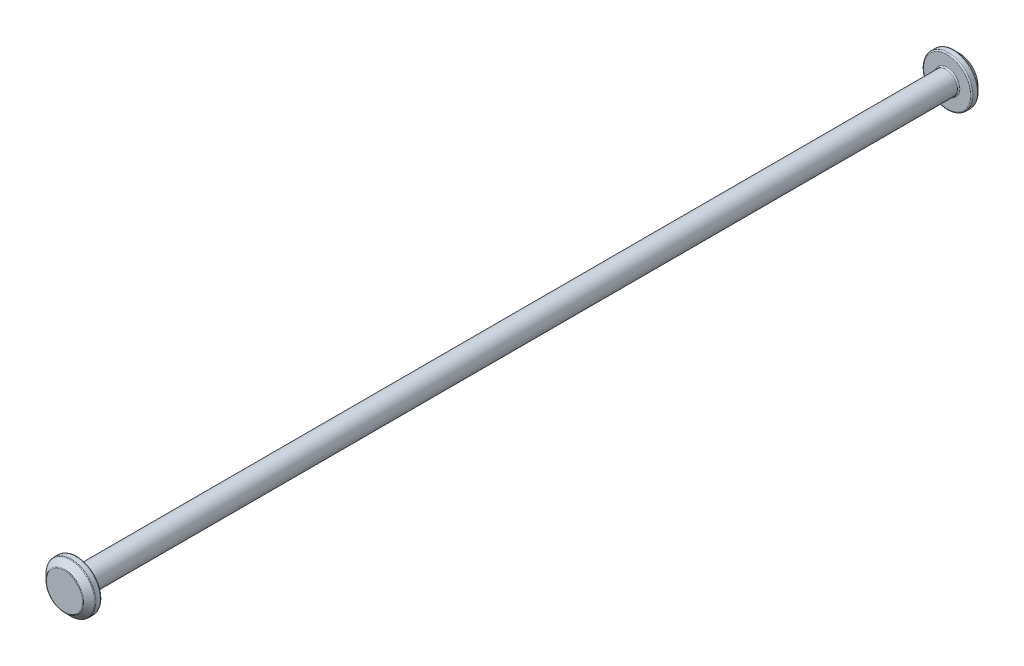
ISO-10303-21;
HEADER;
FILE_DESCRIPTION(('STEP AP214'),'2;1');
FILE_NAME('part.step','',(''),(''),'','','');
FILE_SCHEMA(('AUTOMOTIVE_DESIGN { 1 0 10303 214 1 1 1 1 }'));
ENDSEC;
DATA;
#1=APPLICATION_CONTEXT('core data for automotive mechanical design processes');
#2=APPLICATION_PROTOCOL_DEFINITION('international standard','automotive_design',2000,#1);
#3=PRODUCT_CONTEXT('',#1,'mechanical');
#4=PRODUCT('Part','Part','',(#3));
#5=PRODUCT_RELATED_PRODUCT_CATEGORY('part','',(#4));
#6=PRODUCT_DEFINITION_FORMATION('','',#4);
#7=PRODUCT_DEFINITION_CONTEXT('part definition',#1,'design');
#8=PRODUCT_DEFINITION('design','',#6,#7);
#9=PRODUCT_DEFINITION_SHAPE('','',#8);
#10=(LENGTH_UNIT() NAMED_UNIT(*) SI_UNIT(.MILLI.,.METRE.));
#11=(NAMED_UNIT(*) PLANE_ANGLE_UNIT() SI_UNIT($,.RADIAN.));
#12=(NAMED_UNIT(*) SI_UNIT($,.STERADIAN.) SOLID_ANGLE_UNIT());
#13=UNCERTAINTY_MEASURE_WITH_UNIT(LENGTH_MEASURE(1.E-05),#10,'distance_accuracy_value','');
#14=(GEOMETRIC_REPRESENTATION_CONTEXT(3) GLOBAL_UNCERTAINTY_ASSIGNED_CONTEXT((#13)) GLOBAL_UNIT_ASSIGNED_CONTEXT((#10,
#11,#12)) REPRESENTATION_CONTEXT('',''));
#15=CARTESIAN_POINT('',(0.,0.,0.));
#16=DIRECTION('',(0.,0.,1.));
#17=DIRECTION('',(1.,0.,0.));
#18=AXIS2_PLACEMENT_3D('',#15,#16,#17);
#19=CARTESIAN_POINT('',(0.,0.,35.25));
#20=DIRECTION('',(0.,0.,-1.));
#21=DIRECTION('',(-1.,0.,0.));
#22=AXIS2_PLACEMENT_3D('',#19,#20,#21);
#23=CYLINDRICAL_SURFACE('',#22,0.925);
#24=CARTESIAN_POINT('',(0.,0.,-35.15));
#25=DIRECTION('',(0.,0.,-1.));
#26=DIRECTION('',(-1.,0.,0.));
#27=AXIS2_PLACEMENT_3D('',#24,#25,#26);
#28=CIRCLE('',#27,0.925);
#29=CARTESIAN_POINT('',(-0.925,0.,-35.15));
#30=VERTEX_POINT('',#29);
#31=EDGE_CURVE('E87',#30,#30,#28,.F.);
#32=ORIENTED_EDGE('',*,*,#31,.T.);
#33=EDGE_LOOP('',(#32));
#34=FACE_BOUND('',#33,.T.);
#35=CARTESIAN_POINT('',(0.,0.,35.15));
#36=DIRECTION('',(0.,0.,1.));
#37=DIRECTION('',(1.,0.,0.));
#38=AXIS2_PLACEMENT_3D('',#35,#36,#37);
#39=CIRCLE('',#38,0.925);
#40=CARTESIAN_POINT('',(0.925,0.,35.15));
#41=VERTEX_POINT('',#40);
#42=EDGE_CURVE('E91',#41,#41,#39,.F.);
#43=ORIENTED_EDGE('',*,*,#42,.T.);
#44=EDGE_LOOP('',(#43));
#45=FACE_BOUND('',#44,.T.);
#46=ADVANCED_FACE('F39',(#34,#45),#23,.T.);
#47=CARTESIAN_POINT('',(0.,0.,36.25));
#48=DIRECTION('',(0.,0.,-1.));
#49=DIRECTION('',(-1.,0.,0.));
#50=AXIS2_PLACEMENT_3D('',#47,#48,#49);
#51=CYLINDRICAL_SURFACE('',#50,2.);
#52=CARTESIAN_POINT('',(0.,0.,35.35));
#53=DIRECTION('',(0.,0.,1.));
#54=DIRECTION('',(1.,0.,0.));
#55=AXIS2_PLACEMENT_3D('',#52,#53,#54);
#56=CIRCLE('',#55,2.);
#57=CARTESIAN_POINT('',(2.,0.,35.35));
#58=VERTEX_POINT('',#57);
#59=EDGE_CURVE('E67',#58,#58,#56,.T.);
#60=ORIENTED_EDGE('',*,*,#59,.T.);
#61=EDGE_LOOP('',(#60));
#62=FACE_BOUND('',#61,.T.);
#63=CARTESIAN_POINT('',(0.,0.,35.7085786437627));
#64=DIRECTION('',(0.,0.,1.));
#65=DIRECTION('',(1.,0.,0.));
#66=AXIS2_PLACEMENT_3D('',#63,#64,#65);
#67=CIRCLE('',#66,2.);
#68=CARTESIAN_POINT('',(2.,0.,35.7085786437627));
#69=VERTEX_POINT('',#68);
#70=EDGE_CURVE('E71',#69,#69,#67,.F.);
#71=ORIENTED_EDGE('',*,*,#70,.T.);
#72=EDGE_LOOP('',(#71));
#73=FACE_BOUND('',#72,.T.);
#74=ADVANCED_FACE('F124',(#62,#73),#51,.T.);
#75=CARTESIAN_POINT('',(0.,0.,36.25));
#76=DIRECTION('',(0.,0.,1.));
#77=DIRECTION('',(1.,0.,0.));
#78=AXIS2_PLACEMENT_3D('',#75,#76,#77);
#79=PLANE('',#78);
#80=CARTESIAN_POINT('',(0.,0.,36.25));
#81=DIRECTION('',(0.,0.,1.));
#82=DIRECTION('',(1.,0.,0.));
#83=AXIS2_PLACEMENT_3D('',#80,#81,#82);
#84=CIRCLE('',#83,1.4585786437627);
#85=CARTESIAN_POINT('',(1.4585786437627,0.,36.25));
#86=VERTEX_POINT('',#85);
#87=EDGE_CURVE('E10',#86,#86,#84,.T.);
#88=ORIENTED_EDGE('',*,*,#87,.T.);
#89=EDGE_LOOP('',(#88));
#90=FACE_BOUND('',#89,.T.);
#91=ADVANCED_FACE('F139',(#90),#79,.T.);
#92=CARTESIAN_POINT('',(0.,0.,35.25));
#93=DIRECTION('',(0.,0.,1.));
#94=DIRECTION('',(1.,0.,0.));
#95=AXIS2_PLACEMENT_3D('',#92,#93,#94);
#96=PLANE('',#95);
#97=CARTESIAN_POINT('',(0.,0.,35.25));
#98=DIRECTION('',(0.,0.,1.));
#99=DIRECTION('',(1.,0.,0.));
#100=AXIS2_PLACEMENT_3D('',#97,#98,#99);
#101=CIRCLE('',#100,1.9);
#102=CARTESIAN_POINT('',(1.9,0.,35.25));
#103=VERTEX_POINT('',#102);
#104=EDGE_CURVE('E57',#103,#103,#101,.F.);
#105=ORIENTED_EDGE('',*,*,#104,.T.);
#106=EDGE_LOOP('',(#105));
#107=FACE_BOUND('',#106,.T.);
#108=CARTESIAN_POINT('',(0.,0.,35.25));
#109=DIRECTION('',(0.,0.,1.));
#110=DIRECTION('',(1.,0.,0.));
#111=AXIS2_PLACEMENT_3D('',#108,#109,#110);
#112=CIRCLE('',#111,1.025);
#113=CARTESIAN_POINT('',(1.025,0.,35.25));
#114=VERTEX_POINT('',#113);
#115=EDGE_CURVE('E63',#114,#114,#112,.T.);
#116=ORIENTED_EDGE('',*,*,#115,.T.);
#117=EDGE_LOOP('',(#116));
#118=FACE_BOUND('',#117,.T.);
#119=ADVANCED_FACE('F136',(#107,#118),#96,.F.);
#120=CARTESIAN_POINT('',(0.,0.,36.25));
#121=DIRECTION('',(0.,0.,-1.));
#122=DIRECTION('',(-1.,0.,0.));
#123=AXIS2_PLACEMENT_3D('',#120,#121,#122);
#124=CONICAL_SURFACE('',#123,1.5,0.78539816339744);
#125=CARTESIAN_POINT('',(0.,0.,35.7792893218813));
#126=DIRECTION('',(0.,0.,-1.));
#127=DIRECTION('',(-1.,0.,0.));
#128=AXIS2_PLACEMENT_3D('',#125,#126,#127);
#129=CIRCLE('',#128,1.97071067811866);
#130=CARTESIAN_POINT('',(-1.97071067811866,0.,35.7792893218813));
#131=VERTEX_POINT('',#130);
#132=EDGE_CURVE('E47',#131,#131,#129,.F.);
#133=ORIENTED_EDGE('',*,*,#132,.T.);
#134=EDGE_LOOP('',(#133));
#135=FACE_BOUND('',#134,.T.);
#136=CARTESIAN_POINT('',(0.,0.,36.2207106781186));
#137=DIRECTION('',(0.,0.,1.));
#138=DIRECTION('',(1.,0.,0.));
#139=AXIS2_PLACEMENT_3D('',#136,#137,#138);
#140=CIRCLE('',#139,1.52928932188135);
#141=CARTESIAN_POINT('',(1.52928932188135,0.,36.2207106781186));
#142=VERTEX_POINT('',#141);
#143=EDGE_CURVE('E52',#142,#142,#140,.F.);
#144=ORIENTED_EDGE('',*,*,#143,.T.);
#145=EDGE_LOOP('',(#144));
#146=FACE_BOUND('',#145,.T.);
#147=ADVANCED_FACE('F138',(#135,#146),#124,.T.);
#148=CARTESIAN_POINT('',(0.,0.,-36.25));
#149=DIRECTION('',(0.,0.,1.));
#150=DIRECTION('',(-1.,0.,0.));
#151=AXIS2_PLACEMENT_3D('',#148,#149,#150);
#152=CYLINDRICAL_SURFACE('',#151,2.);
#153=CARTESIAN_POINT('',(0.,0.,-35.35));
#154=DIRECTION('',(0.,0.,-1.));
#155=DIRECTION('',(-1.,0.,0.));
#156=AXIS2_PLACEMENT_3D('',#153,#154,#155);
#157=CIRCLE('',#156,2.);
#158=CARTESIAN_POINT('',(-2.,0.,-35.35));
#159=VERTEX_POINT('',#158);
#160=EDGE_CURVE('E95',#159,#159,#157,.T.);
#161=ORIENTED_EDGE('',*,*,#160,.T.);
#162=EDGE_LOOP('',(#161));
#163=FACE_BOUND('',#162,.T.);
#164=CARTESIAN_POINT('',(0.,0.,-35.7085786437627));
#165=DIRECTION('',(0.,0.,1.));
#166=DIRECTION('',(1.,0.,0.));
#167=AXIS2_PLACEMENT_3D('',#164,#165,#166);
#168=CIRCLE('',#167,2.);
#169=CARTESIAN_POINT('',(2.,0.,-35.7085786437627));
#170=VERTEX_POINT('',#169);
#171=EDGE_CURVE('E99',#170,#170,#168,.T.);
#172=ORIENTED_EDGE('',*,*,#171,.T.);
#173=EDGE_LOOP('',(#172));
#174=FACE_BOUND('',#173,.T.);
#175=ADVANCED_FACE('F146',(#163,#174),#152,.T.);
#176=CARTESIAN_POINT('',(0.,0.,-36.25));
#177=DIRECTION('',(0.,0.,-1.));
#178=DIRECTION('',(1.,0.,0.));
#179=AXIS2_PLACEMENT_3D('',#176,#177,#178);
#180=PLANE('',#179);
#181=CARTESIAN_POINT('',(0.,0.,-36.25));
#182=DIRECTION('',(0.,0.,-1.));
#183=DIRECTION('',(-1.,0.,0.));
#184=AXIS2_PLACEMENT_3D('',#181,#182,#183);
#185=CIRCLE('',#184,1.4585786437627);
#186=CARTESIAN_POINT('',(-1.4585786437627,0.,-36.25));
#187=VERTEX_POINT('',#186);
#188=EDGE_CURVE('E75',#187,#187,#185,.T.);
#189=ORIENTED_EDGE('',*,*,#188,.T.);
#190=EDGE_LOOP('',(#189));
#191=FACE_BOUND('',#190,.T.);
#192=ADVANCED_FACE('F241',(#191),#180,.T.);
#193=CARTESIAN_POINT('',(0.,0.,-35.25));
#194=DIRECTION('',(0.,0.,-1.));
#195=DIRECTION('',(1.,0.,0.));
#196=AXIS2_PLACEMENT_3D('',#193,#194,#195);
#197=PLANE('',#196);
#198=CARTESIAN_POINT('',(0.,0.,-35.25));
#199=DIRECTION('',(0.,0.,-1.));
#200=DIRECTION('',(-1.,0.,0.));
#201=AXIS2_PLACEMENT_3D('',#198,#199,#200);
#202=CIRCLE('',#201,1.9);
#203=CARTESIAN_POINT('',(-1.9,0.,-35.25));
#204=VERTEX_POINT('',#203);
#205=EDGE_CURVE('E103',#204,#204,#202,.F.);
#206=ORIENTED_EDGE('',*,*,#205,.T.);
#207=EDGE_LOOP('',(#206));
#208=FACE_BOUND('',#207,.T.);
#209=CARTESIAN_POINT('',(0.,0.,-35.25));
#210=DIRECTION('',(0.,0.,-1.));
#211=DIRECTION('',(-1.,0.,0.));
#212=AXIS2_PLACEMENT_3D('',#209,#210,#211);
#213=CIRCLE('',#212,1.025);
#214=CARTESIAN_POINT('',(-1.025,0.,-35.25));
#215=VERTEX_POINT('',#214);
#216=EDGE_CURVE('E107',#215,#215,#213,.T.);
#217=ORIENTED_EDGE('',*,*,#216,.T.);
#218=EDGE_LOOP('',(#217));
#219=FACE_BOUND('',#218,.T.);
#220=ADVANCED_FACE('F112',(#208,#219),#197,.F.);
#221=CARTESIAN_POINT('',(0.,0.,-36.25));
#222=DIRECTION('',(0.,0.,1.));
#223=DIRECTION('',(-1.,0.,0.));
#224=AXIS2_PLACEMENT_3D('',#221,#222,#223);
#225=CONICAL_SURFACE('',#224,1.5,0.78539816339744);
#226=CARTESIAN_POINT('',(0.,0.,-36.2207106781186));
#227=DIRECTION('',(0.,0.,-1.));
#228=DIRECTION('',(-1.,0.,0.));
#229=AXIS2_PLACEMENT_3D('',#226,#227,#228);
#230=CIRCLE('',#229,1.52928932188135);
#231=CARTESIAN_POINT('',(-1.52928932188135,0.,-36.2207106781186));
#232=VERTEX_POINT('',#231);
#233=EDGE_CURVE('E79',#232,#232,#230,.F.);
#234=ORIENTED_EDGE('',*,*,#233,.T.);
#235=EDGE_LOOP('',(#234));
#236=FACE_BOUND('',#235,.T.);
#237=CARTESIAN_POINT('',(0.,0.,-35.7792893218813));
#238=DIRECTION('',(0.,0.,1.));
#239=DIRECTION('',(1.,0.,0.));
#240=AXIS2_PLACEMENT_3D('',#237,#238,#239);
#241=CIRCLE('',#240,1.97071067811866);
#242=CARTESIAN_POINT('',(1.97071067811866,0.,-35.7792893218813));
#243=VERTEX_POINT('',#242);
#244=EDGE_CURVE('E83',#243,#243,#241,.F.);
#245=ORIENTED_EDGE('',*,*,#244,.T.);
#246=EDGE_LOOP('',(#245));
#247=FACE_BOUND('',#246,.T.);
#248=ADVANCED_FACE('F158',(#236,#247),#225,.T.);
#249=CARTESIAN_POINT('',(0.,0.,-35.35));
#250=DIRECTION('',(0.,0.,-1.));
#251=DIRECTION('',(-1.,0.,0.));
#252=AXIS2_PLACEMENT_3D('',#249,#250,#251);
#253=TOROIDAL_SURFACE('',#252,1.9,0.1);
#254=ORIENTED_EDGE('',*,*,#160,.F.);
#255=EDGE_LOOP('',(#254));
#256=FACE_BOUND('',#255,.T.);
#257=ORIENTED_EDGE('',*,*,#205,.F.);
#258=EDGE_LOOP('',(#257));
#259=FACE_BOUND('',#258,.T.);
#260=ADVANCED_FACE('F118',(#256,#259),#253,.T.);
#261=CARTESIAN_POINT('',(0.,0.,-35.15));
#262=DIRECTION('',(0.,0.,-1.));
#263=DIRECTION('',(-1.,0.,0.));
#264=AXIS2_PLACEMENT_3D('',#261,#262,#263);
#265=TOROIDAL_SURFACE('',#264,1.025,0.1);
#266=ORIENTED_EDGE('',*,*,#216,.F.);
#267=EDGE_LOOP('',(#266));
#268=FACE_BOUND('',#267,.T.);
#269=ORIENTED_EDGE('',*,*,#31,.F.);
#270=EDGE_LOOP('',(#269));
#271=FACE_BOUND('',#270,.T.);
#272=ADVANCED_FACE('F114',(#268,#271),#265,.F.);
#273=CARTESIAN_POINT('',(0.,0.,-36.15));
#274=DIRECTION('',(0.,0.,-1.));
#275=DIRECTION('',(-1.,0.,0.));
#276=AXIS2_PLACEMENT_3D('',#273,#274,#275);
#277=TOROIDAL_SURFACE('',#276,1.4585786437627,0.1);
#278=ORIENTED_EDGE('',*,*,#188,.F.);
#279=EDGE_LOOP('',(#278));
#280=FACE_BOUND('',#279,.T.);
#281=ORIENTED_EDGE('',*,*,#233,.F.);
#282=EDGE_LOOP('',(#281));
#283=FACE_BOUND('',#282,.T.);
#284=ADVANCED_FACE('F117',(#280,#283),#277,.T.);
#285=CARTESIAN_POINT('',(0.,0.,-35.7085786437627));
#286=DIRECTION('',(0.,0.,1.));
#287=DIRECTION('',(1.,0.,0.));
#288=AXIS2_PLACEMENT_3D('',#285,#286,#287);
#289=TOROIDAL_SURFACE('',#288,1.9,0.1);
#290=ORIENTED_EDGE('',*,*,#171,.F.);
#291=EDGE_LOOP('',(#290));
#292=FACE_BOUND('',#291,.T.);
#293=ORIENTED_EDGE('',*,*,#244,.F.);
#294=EDGE_LOOP('',(#293));
#295=FACE_BOUND('',#294,.T.);
#296=ADVANCED_FACE('F163',(#292,#295),#289,.T.);
#297=CARTESIAN_POINT('',(0.,0.,35.35));
#298=DIRECTION('',(0.,0.,1.));
#299=DIRECTION('',(1.,0.,0.));
#300=AXIS2_PLACEMENT_3D('',#297,#298,#299);
#301=TOROIDAL_SURFACE('',#300,1.9,0.1);
#302=ORIENTED_EDGE('',*,*,#104,.F.);
#303=EDGE_LOOP('',(#302));
#304=FACE_BOUND('',#303,.T.);
#305=ORIENTED_EDGE('',*,*,#59,.F.);
#306=EDGE_LOOP('',(#305));
#307=FACE_BOUND('',#306,.T.);
#308=ADVANCED_FACE('F132',(#304,#307),#301,.T.);
#309=CARTESIAN_POINT('',(0.,0.,35.15));
#310=DIRECTION('',(0.,0.,1.));
#311=DIRECTION('',(1.,0.,0.));
#312=AXIS2_PLACEMENT_3D('',#309,#310,#311);
#313=TOROIDAL_SURFACE('',#312,1.025,0.1);
#314=ORIENTED_EDGE('',*,*,#42,.F.);
#315=EDGE_LOOP('',(#314));
#316=FACE_BOUND('',#315,.T.);
#317=ORIENTED_EDGE('',*,*,#115,.F.);
#318=EDGE_LOOP('',(#317));
#319=FACE_BOUND('',#318,.T.);
#320=ADVANCED_FACE('F128',(#316,#319),#313,.F.);
#321=CARTESIAN_POINT('',(0.,0.,35.7085786437627));
#322=DIRECTION('',(0.,0.,1.));
#323=DIRECTION('',(1.,0.,0.));
#324=AXIS2_PLACEMENT_3D('',#321,#322,#323);
#325=TOROIDAL_SURFACE('',#324,1.9,0.1);
#326=ORIENTED_EDGE('',*,*,#132,.F.);
#327=EDGE_LOOP('',(#326));
#328=FACE_BOUND('',#327,.T.);
#329=ORIENTED_EDGE('',*,*,#70,.F.);
#330=EDGE_LOOP('',(#329));
#331=FACE_BOUND('',#330,.T.);
#332=ADVANCED_FACE('F131',(#328,#331),#325,.T.);
#333=CARTESIAN_POINT('',(0.,0.,36.15));
#334=DIRECTION('',(0.,0.,1.));
#335=DIRECTION('',(1.,0.,0.));
#336=AXIS2_PLACEMENT_3D('',#333,#334,#335);
#337=TOROIDAL_SURFACE('',#336,1.4585786437627,0.1);
#338=ORIENTED_EDGE('',*,*,#143,.F.);
#339=EDGE_LOOP('',(#338));
#340=FACE_BOUND('',#339,.T.);
#341=ORIENTED_EDGE('',*,*,#87,.F.);
#342=EDGE_LOOP('',(#341));
#343=FACE_BOUND('',#342,.T.);
#344=ADVANCED_FACE('F41',(#340,#343),#337,.T.);
#345=CLOSED_SHELL('',(#46,#74,#91,#119,#147,#175,#192,#220,#248,#260,#272,#284,#296,#308,#320,
#332,#344));
#346=MANIFOLD_SOLID_BREP('B2',#345);
#347=ADVANCED_BREP_SHAPE_REPRESENTATION('',(#18,#346),#14);
#348=SHAPE_DEFINITION_REPRESENTATION(#9,#347);
ENDSEC;
END-ISO-10303-21;
